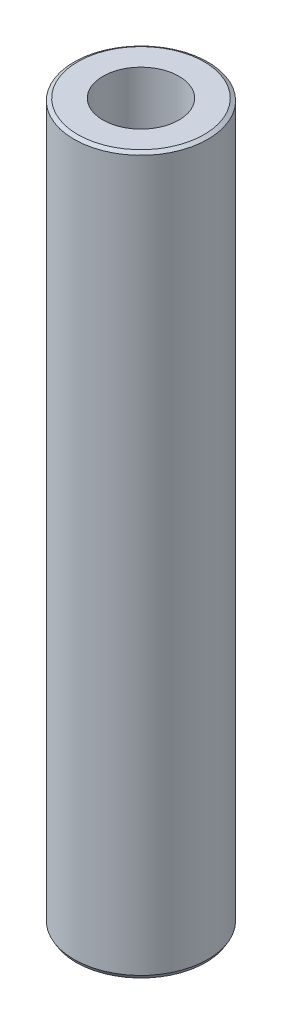
ISO-10303-21;
HEADER;
FILE_DESCRIPTION(('STEP AP214'),'2;1');
FILE_NAME('part.step','',(''),(''),'','','');
FILE_SCHEMA(('AUTOMOTIVE_DESIGN { 1 0 10303 214 1 1 1 1 }'));
ENDSEC;
DATA;
#1=APPLICATION_CONTEXT('core data for automotive mechanical design processes');
#2=APPLICATION_PROTOCOL_DEFINITION('international standard','automotive_design',2000,#1);
#3=PRODUCT_CONTEXT('',#1,'mechanical');
#4=PRODUCT('Part','Part','',(#3));
#5=PRODUCT_RELATED_PRODUCT_CATEGORY('part','',(#4));
#6=PRODUCT_DEFINITION_FORMATION('','',#4);
#7=PRODUCT_DEFINITION_CONTEXT('part definition',#1,'design');
#8=PRODUCT_DEFINITION('design','',#6,#7);
#9=PRODUCT_DEFINITION_SHAPE('','',#8);
#10=(LENGTH_UNIT() NAMED_UNIT(*) SI_UNIT(.MILLI.,.METRE.));
#11=(NAMED_UNIT(*) PLANE_ANGLE_UNIT() SI_UNIT($,.RADIAN.));
#12=(NAMED_UNIT(*) SI_UNIT($,.STERADIAN.) SOLID_ANGLE_UNIT());
#13=UNCERTAINTY_MEASURE_WITH_UNIT(LENGTH_MEASURE(1.E-05),#10,'distance_accuracy_value','');
#14=(GEOMETRIC_REPRESENTATION_CONTEXT(3) GLOBAL_UNCERTAINTY_ASSIGNED_CONTEXT((#13)) GLOBAL_UNIT_ASSIGNED_CONTEXT((#10,
#11,#12)) REPRESENTATION_CONTEXT('',''));
#15=CARTESIAN_POINT('',(0.,0.,0.));
#16=DIRECTION('',(0.,0.,1.));
#17=DIRECTION('',(1.,0.,0.));
#18=AXIS2_PLACEMENT_3D('',#15,#16,#17);
#19=CARTESIAN_POINT('',(0.,374.450062968658,0.));
#20=DIRECTION('',(0.,-1.,0.));
#21=DIRECTION('',(0.,0.,-1.));
#22=AXIS2_PLACEMENT_3D('',#19,#20,#21);
#23=CYLINDRICAL_SURFACE('',#22,35.);
#24=CARTESIAN_POINT('',(0.,373.310125563832,0.));
#25=DIRECTION('',(0.,1.,0.));
#26=DIRECTION('',(0.,0.,1.));
#27=AXIS2_PLACEMENT_3D('',#24,#25,#26);
#28=CIRCLE('',#27,35.);
#29=CARTESIAN_POINT('',(0.,373.310125563832,35.));
#30=VERTEX_POINT('',#29);
#31=EDGE_CURVE('E50',#30,#30,#28,.F.);
#32=ORIENTED_EDGE('',*,*,#31,.T.);
#33=EDGE_LOOP('',(#32));
#34=FACE_BOUND('',#33,.T.);
#35=CARTESIAN_POINT('',(0.,1.97442950260684,0.));
#36=DIRECTION('',(0.,1.,0.));
#37=DIRECTION('',(0.,0.,1.));
#38=AXIS2_PLACEMENT_3D('',#35,#36,#37);
#39=CIRCLE('',#38,35.);
#40=CARTESIAN_POINT('',(0.,1.97442950260684,35.));
#41=VERTEX_POINT('',#40);
#42=EDGE_CURVE('E51',#41,#41,#39,.T.);
#43=ORIENTED_EDGE('',*,*,#42,.T.);
#44=EDGE_LOOP('',(#43));
#45=FACE_BOUND('',#44,.T.);
#46=ADVANCED_FACE('F39',(#34,#45),#23,.T.);
#47=CARTESIAN_POINT('',(0.,374.450062968658,0.));
#48=DIRECTION('',(0.,1.,0.));
#49=DIRECTION('',(0.,0.,1.));
#50=AXIS2_PLACEMENT_3D('',#47,#48,#49);
#51=PLANE('',#50);
#52=CARTESIAN_POINT('',(0.,374.450062968658,0.));
#53=DIRECTION('',(0.,1.,0.));
#54=DIRECTION('',(0.,0.,1.));
#55=AXIS2_PLACEMENT_3D('',#52,#53,#54);
#56=CIRCLE('',#55,33.0255704973932);
#57=CARTESIAN_POINT('',(0.,374.450062968658,33.0255704973932));
#58=VERTEX_POINT('',#57);
#59=EDGE_CURVE('E54',#58,#58,#56,.T.);
#60=ORIENTED_EDGE('',*,*,#59,.T.);
#61=EDGE_LOOP('',(#60));
#62=FACE_BOUND('',#61,.T.);
#63=CARTESIAN_POINT('',(0.,374.450062968658,0.));
#64=DIRECTION('',(0.,1.,0.));
#65=DIRECTION('',(0.,0.,1.));
#66=AXIS2_PLACEMENT_3D('',#63,#64,#65);
#67=CIRCLE('',#66,19.8575524914541);
#68=CARTESIAN_POINT('',(0.,374.450062968658,19.8575524914541));
#69=VERTEX_POINT('',#68);
#70=EDGE_CURVE('E58',#69,#69,#67,.T.);
#71=ORIENTED_EDGE('',*,*,#70,.F.);
#72=EDGE_LOOP('',(#71));
#73=FACE_BOUND('',#72,.T.);
#74=ADVANCED_FACE('F69',(#62,#73),#51,.T.);
#75=CARTESIAN_POINT('',(0.,0.,0.));
#76=DIRECTION('',(0.,1.,0.));
#77=DIRECTION('',(0.,0.,1.));
#78=AXIS2_PLACEMENT_3D('',#75,#76,#77);
#79=PLANE('',#78);
#80=CARTESIAN_POINT('',(0.,0.,0.));
#81=DIRECTION('',(0.,1.,0.));
#82=DIRECTION('',(0.,0.,1.));
#83=AXIS2_PLACEMENT_3D('',#80,#81,#82);
#84=CIRCLE('',#83,33.860062595174);
#85=CARTESIAN_POINT('',(0.,0.,33.860062595174));
#86=VERTEX_POINT('',#85);
#87=EDGE_CURVE('E10',#86,#86,#84,.F.);
#88=ORIENTED_EDGE('',*,*,#87,.T.);
#89=EDGE_LOOP('',(#88));
#90=FACE_BOUND('',#89,.T.);
#91=CARTESIAN_POINT('',(0.,0.,0.));
#92=DIRECTION('',(0.,1.,0.));
#93=DIRECTION('',(0.,0.,1.));
#94=AXIS2_PLACEMENT_3D('',#91,#92,#93);
#95=CIRCLE('',#94,19.8575524914541);
#96=CARTESIAN_POINT('',(0.,0.,19.8575524914541));
#97=VERTEX_POINT('',#96);
#98=EDGE_CURVE('E63',#97,#97,#95,.T.);
#99=ORIENTED_EDGE('',*,*,#98,.T.);
#100=EDGE_LOOP('',(#99));
#101=FACE_BOUND('',#100,.T.);
#102=ADVANCED_FACE('F75',(#90,#101),#79,.F.);
#103=CARTESIAN_POINT('',(0.,374.450062968658,0.));
#104=DIRECTION('',(0.,-1.,0.));
#105=DIRECTION('',(0.,0.,-1.));
#106=AXIS2_PLACEMENT_3D('',#103,#104,#105);
#107=CYLINDRICAL_SURFACE('',#106,19.8575524914541);
#108=ORIENTED_EDGE('',*,*,#70,.T.);
#109=EDGE_LOOP('',(#108));
#110=FACE_BOUND('',#109,.T.);
#111=ORIENTED_EDGE('',*,*,#98,.F.);
#112=EDGE_LOOP('',(#111));
#113=FACE_BOUND('',#112,.T.);
#114=ADVANCED_FACE('F70',(#110,#113),#107,.F.);
#115=CARTESIAN_POINT('',(0.,374.450062968658,0.));
#116=DIRECTION('',(0.,-1.,0.));
#117=DIRECTION('',(0.,0.,-1.));
#118=AXIS2_PLACEMENT_3D('',#115,#116,#117);
#119=CONICAL_SURFACE('',#118,33.0255704973932,1.04719755119658);
#120=ORIENTED_EDGE('',*,*,#31,.F.);
#121=EDGE_LOOP('',(#120));
#122=FACE_BOUND('',#121,.T.);
#123=ORIENTED_EDGE('',*,*,#59,.F.);
#124=EDGE_LOOP('',(#123));
#125=FACE_BOUND('',#124,.T.);
#126=ADVANCED_FACE('F81',(#122,#125),#119,.T.);
#127=CARTESIAN_POINT('',(0.,1.97442950260684,0.));
#128=DIRECTION('',(0.,1.,0.));
#129=DIRECTION('',(0.,0.,1.));
#130=AXIS2_PLACEMENT_3D('',#127,#128,#129);
#131=CONICAL_SURFACE('',#130,35.,0.523598775598317);
#132=ORIENTED_EDGE('',*,*,#87,.F.);
#133=EDGE_LOOP('',(#132));
#134=FACE_BOUND('',#133,.T.);
#135=ORIENTED_EDGE('',*,*,#42,.F.);
#136=EDGE_LOOP('',(#135));
#137=FACE_BOUND('',#136,.T.);
#138=ADVANCED_FACE('F45',(#134,#137),#131,.T.);
#139=CLOSED_SHELL('',(#46,#74,#102,#114,#126,#138));
#140=MANIFOLD_SOLID_BREP('B2',#139);
#141=ADVANCED_BREP_SHAPE_REPRESENTATION('',(#18,#140),#14);
#142=SHAPE_DEFINITION_REPRESENTATION(#9,#141);
ENDSEC;
END-ISO-10303-21;
